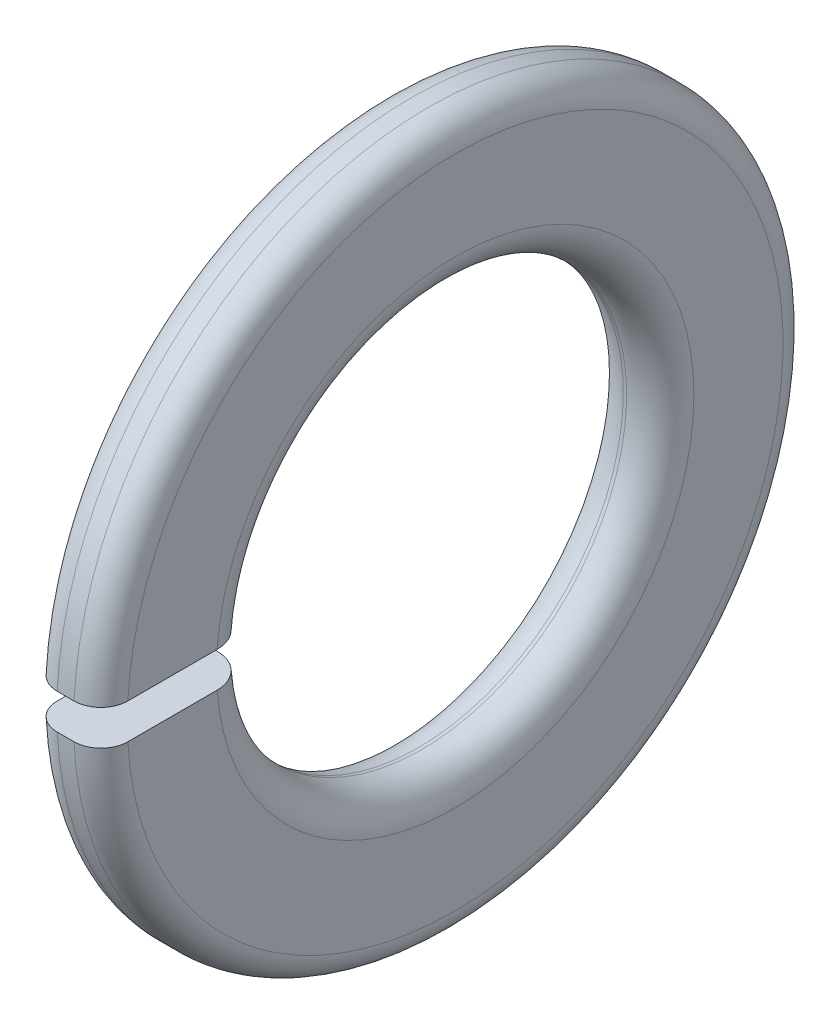
ISO-10303-21;
HEADER;
FILE_DESCRIPTION(('STEP AP214'),'2;1');
FILE_NAME('part.step','',(''),(''),'','','');
FILE_SCHEMA(('AUTOMOTIVE_DESIGN { 1 0 10303 214 1 1 1 1 }'));
ENDSEC;
DATA;
#1=APPLICATION_CONTEXT('core data for automotive mechanical design processes');
#2=APPLICATION_PROTOCOL_DEFINITION('international standard','automotive_design',2000,#1);
#3=PRODUCT_CONTEXT('',#1,'mechanical');
#4=PRODUCT('Part','Part','',(#3));
#5=PRODUCT_RELATED_PRODUCT_CATEGORY('part','',(#4));
#6=PRODUCT_DEFINITION_FORMATION('','',#4);
#7=PRODUCT_DEFINITION_CONTEXT('part definition',#1,'design');
#8=PRODUCT_DEFINITION('design','',#6,#7);
#9=PRODUCT_DEFINITION_SHAPE('','',#8);
#10=(LENGTH_UNIT() NAMED_UNIT(*) SI_UNIT(.MILLI.,.METRE.));
#11=(NAMED_UNIT(*) PLANE_ANGLE_UNIT() SI_UNIT($,.RADIAN.));
#12=(NAMED_UNIT(*) SI_UNIT($,.STERADIAN.) SOLID_ANGLE_UNIT());
#13=UNCERTAINTY_MEASURE_WITH_UNIT(LENGTH_MEASURE(1.E-05),#10,'distance_accuracy_value','');
#14=(GEOMETRIC_REPRESENTATION_CONTEXT(3) GLOBAL_UNCERTAINTY_ASSIGNED_CONTEXT((#13)) GLOBAL_UNIT_ASSIGNED_CONTEXT((#10,
#11,#12)) REPRESENTATION_CONTEXT('',''));
#15=CARTESIAN_POINT('',(0.,0.,0.));
#16=DIRECTION('',(0.,0.,1.));
#17=DIRECTION('',(1.,0.,0.));
#18=AXIS2_PLACEMENT_3D('',#15,#16,#17);
#19=CARTESIAN_POINT('',(-34.925,0.,0.));
#20=DIRECTION('',(-1.,0.,0.));
#21=DIRECTION('',(0.,0.,1.));
#22=AXIS2_PLACEMENT_3D('',#19,#20,#21);
#23=CYLINDRICAL_SURFACE('',#22,10.55);
#24=DIRECTION('',(-1.,0.,0.));
#25=VECTOR('',#24,1.);
#26=CARTESIAN_POINT('',(-34.925,0.525,10.5369291067179));
#27=LINE('',#26,#25);
#28=CARTESIAN_POINT('',(-0.8,0.525,10.5369291067179));
#29=VERTEX_POINT('',#28);
#30=CARTESIAN_POINT('',(-1.3,0.525,10.5369291067179));
#31=VERTEX_POINT('',#30);
#32=EDGE_CURVE('E169',#29,#31,#27,.T.);
#33=ORIENTED_EDGE('',*,*,#32,.F.);
#34=CARTESIAN_POINT('',(-0.8,0.,0.));
#35=DIRECTION('',(-1.,0.,0.));
#36=DIRECTION('',(0.,0.,1.));
#37=AXIS2_PLACEMENT_3D('',#34,#35,#36);
#38=CIRCLE('',#37,10.55);
#39=CARTESIAN_POINT('',(-0.8,-0.525,10.5369291067179));
#40=VERTEX_POINT('',#39);
#41=EDGE_CURVE('E118',#29,#40,#38,.T.);
#42=ORIENTED_EDGE('',*,*,#41,.T.);
#43=DIRECTION('',(-1.,0.,0.));
#44=VECTOR('',#43,1.);
#45=CARTESIAN_POINT('',(-34.925,-0.525,10.5369291067179));
#46=LINE('',#45,#44);
#47=CARTESIAN_POINT('',(-1.3,-0.525,10.5369291067179));
#48=VERTEX_POINT('',#47);
#49=EDGE_CURVE('E101',#48,#40,#46,.F.);
#50=ORIENTED_EDGE('',*,*,#49,.F.);
#51=CARTESIAN_POINT('',(-1.3,0.,0.));
#52=DIRECTION('',(1.,0.,0.));
#53=DIRECTION('',(0.,0.,-1.));
#54=AXIS2_PLACEMENT_3D('',#51,#52,#53);
#55=CIRCLE('',#54,10.55);
#56=EDGE_CURVE('E116',#48,#31,#55,.T.);
#57=ORIENTED_EDGE('',*,*,#56,.T.);
#58=EDGE_LOOP('',(#33,#42,#50,#57));
#59=FACE_BOUND('',#58,.T.);
#60=ADVANCED_FACE('F16',(#59),#23,.T.);
#61=CARTESIAN_POINT('',(0.,7.1,0.));
#62=DIRECTION('',(-1.,0.,0.));
#63=DIRECTION('',(0.,0.,1.));
#64=AXIS2_PLACEMENT_3D('',#61,#62,#63);
#65=PLANE('',#64);
#66=DIRECTION('',(0.,0.,1.));
#67=VECTOR('',#66,1.);
#68=CARTESIAN_POINT('',(0.,-0.525,0.));
#69=LINE('',#68,#67);
#70=CARTESIAN_POINT('',(0.,-0.525,7.08056318381525));
#71=VERTEX_POINT('',#70);
#72=CARTESIAN_POINT('',(0.,-0.525,9.73585512423023));
#73=VERTEX_POINT('',#72);
#74=EDGE_CURVE('E82',#71,#73,#69,.T.);
#75=ORIENTED_EDGE('',*,*,#74,.T.);
#76=CARTESIAN_POINT('',(0.,0.,0.));
#77=DIRECTION('',(-1.,0.,0.));
#78=DIRECTION('',(0.,0.,1.));
#79=AXIS2_PLACEMENT_3D('',#76,#77,#78);
#80=CIRCLE('',#79,9.75);
#81=CARTESIAN_POINT('',(0.,0.525,9.73585512423023));
#82=VERTEX_POINT('',#81);
#83=EDGE_CURVE('E40',#73,#82,#80,.F.);
#84=ORIENTED_EDGE('',*,*,#83,.T.);
#85=DIRECTION('',(0.,0.,-1.));
#86=VECTOR('',#85,1.);
#87=CARTESIAN_POINT('',(0.,0.525,10.761));
#88=LINE('',#87,#86);
#89=CARTESIAN_POINT('',(0.,0.525,7.08056318381525));
#90=VERTEX_POINT('',#89);
#91=EDGE_CURVE('E91',#82,#90,#88,.T.);
#92=ORIENTED_EDGE('',*,*,#91,.T.);
#93=CARTESIAN_POINT('',(0.,0.,0.));
#94=DIRECTION('',(-1.,0.,0.));
#95=DIRECTION('',(0.,0.,1.));
#96=AXIS2_PLACEMENT_3D('',#93,#94,#95);
#97=CIRCLE('',#96,7.1);
#98=EDGE_CURVE('E98',#90,#71,#97,.T.);
#99=ORIENTED_EDGE('',*,*,#98,.T.);
#100=EDGE_LOOP('',(#75,#84,#92,#99));
#101=FACE_BOUND('',#100,.T.);
#102=ADVANCED_FACE('F104',(#101),#65,.F.);
#103=CARTESIAN_POINT('',(-1.,0.,0.));
#104=DIRECTION('',(-1.,0.,0.));
#105=DIRECTION('',(0.,0.,1.));
#106=AXIS2_PLACEMENT_3D('',#103,#104,#105);
#107=TOROIDAL_SURFACE('',#106,7.1,1.);
#108=ORIENTED_EDGE('',*,*,#98,.F.);
#109=CARTESIAN_POINT('',(-0.812651191733093,0.525,6.09513809676691));
#110=CARTESIAN_POINT('',(-0.867635601609137,0.525,6.08461486650465));
#111=CARTESIAN_POINT('',(-0.923548451885151,0.525,6.07872721250442));
#112=CARTESIAN_POINT('',(-1.03561462486792,0.525,6.07642288324873));
#113=CARTESIAN_POINT('',(-1.09176815419271,0.525,6.0800174545316));
#114=CARTESIAN_POINT('',(-1.20265038202385,0.525,6.09658440071776));
#115=CARTESIAN_POINT('',(-1.25737978521658,0.525,6.1095520425659));
#116=CARTESIAN_POINT('',(-1.3638725672551,0.525,6.1444807255819));
#117=CARTESIAN_POINT('',(-1.41563665183698,0.525,6.16643961664033));
#118=CARTESIAN_POINT('',(-1.51480465325,0.525,6.21874173811228));
#119=CARTESIAN_POINT('',(-1.56220424214722,0.525,6.24909317391404));
#120=CARTESIAN_POINT('',(-1.65125714513638,0.525,6.31730121336709));
#121=CARTESIAN_POINT('',(-1.69291015600293,0.525,6.35515821280219));
#122=CARTESIAN_POINT('',(-1.76942266073897,0.525,6.43742442778353));
#123=CARTESIAN_POINT('',(-1.80426101306002,0.525,6.48185330577895));
#124=CARTESIAN_POINT('',(-1.86601254338545,0.525,6.57591381055086));
#125=CARTESIAN_POINT('',(-1.89292559206825,0.525,6.62554552220696));
#126=CARTESIAN_POINT('',(-1.93814923335002,0.525,6.72877362821626));
#127=CARTESIAN_POINT('',(-1.9564321571561,0.525,6.78238214534372));
#128=CARTESIAN_POINT('',(-1.98375580773735,0.525,6.89190498853626));
#129=CARTESIAN_POINT('',(-1.99279644616772,0.525,6.94781933663691));
#130=CARTESIAN_POINT('',(-2.00138749269398,0.525,7.06046876730558));
#131=CARTESIAN_POINT('',(-2.00092170716772,0.525,7.11720508578784));
#132=CARTESIAN_POINT('',(-1.99046919624137,0.525,7.22979418626396));
#133=CARTESIAN_POINT('',(-1.98048245114082,0.525,7.28564696642937));
#134=CARTESIAN_POINT('',(-1.9512682999192,0.525,7.39486566816648));
#135=CARTESIAN_POINT('',(-1.93204335803051,0.525,7.4482322487549));
#136=CARTESIAN_POINT('',(-1.88489151384658,0.525,7.55097199946706));
#137=CARTESIAN_POINT('',(-1.85696468214513,0.525,7.60034520198285));
#138=CARTESIAN_POINT('',(-1.7932516504448,0.525,7.69360308767889));
#139=CARTESIAN_POINT('',(-1.75747923413963,0.525,7.73749718733122));
#140=CARTESIAN_POINT('',(-1.67905745237818,0.525,7.81863927947804));
#141=CARTESIAN_POINT('',(-1.63640816840443,0.525,7.85588735070889));
#142=CARTESIAN_POINT('',(-1.54554883853143,0.525,7.92258902486458));
#143=CARTESIAN_POINT('',(-1.49735183074451,0.525,7.95206038814106));
#144=CARTESIAN_POINT('',(-1.39668650789301,0.525,8.00247439358284));
#145=CARTESIAN_POINT('',(-1.34421824229176,0.525,8.02341713449703));
#146=CARTESIAN_POINT('',(-1.23661255133491,0.525,8.05613801790862));
#147=CARTESIAN_POINT('',(-1.181480660204,0.525,8.06793436177104));
#148=CARTESIAN_POINT('',(-1.07001859143634,0.525,8.08209258223702));
#149=CARTESIAN_POINT('',(-1.01368842280445,0.525,8.08445452971335));
#150=CARTESIAN_POINT('',(-0.901493761658643,0.525,8.07967876415045));
#151=CARTESIAN_POINT('',(-0.845628830361041,0.525,8.07255135099469));
#152=CARTESIAN_POINT('',(-0.735888488372699,0.525,8.04901957603885));
#153=CARTESIAN_POINT('',(-0.682013074234786,0.525,8.03261523031341));
#154=CARTESIAN_POINT('',(-0.57777299393378,0.525,7.99099755957706));
#155=CARTESIAN_POINT('',(-0.527408710817191,0.525,7.96578327524504));
#156=CARTESIAN_POINT('',(-0.431620952055953,0.525,7.90726737931522));
#157=CARTESIAN_POINT('',(-0.386197502187286,0.525,7.87396572552912));
#158=CARTESIAN_POINT('',(-0.301516745674806,0.525,7.80017762775325));
#159=CARTESIAN_POINT('',(-0.26226736487093,0.525,7.75968208840675));
#160=CARTESIAN_POINT('',(-0.19110727232965,0.525,7.67268846366961));
#161=CARTESIAN_POINT('',(-0.159196627376645,0.525,7.62619032365977));
#162=CARTESIAN_POINT('',(-0.103547358484065,0.525,7.52840777006826));
#163=CARTESIAN_POINT('',(-0.0798260108357957,0.525,7.47711352456286));
#164=CARTESIAN_POINT('',(-0.0413094029115143,0.525,7.37127661987106));
#165=CARTESIAN_POINT('',(-0.0265142736222085,0.525,7.31673391302841));
#166=CARTESIAN_POINT('',(-0.00623645854835663,0.525,7.20581585945528));
#167=CARTESIAN_POINT('',(-0.000774997327997569,0.525,7.14943663215111));
#168=CARTESIAN_POINT('',(0.000621201945927826,0.525,7.03656007759808));
#169=CARTESIAN_POINT('',(-0.00344418247725166,0.525,6.98006274884024));
#170=CARTESIAN_POINT('',(-0.0209988630405946,0.525,6.86845999383313));
#171=CARTESIAN_POINT('',(-0.034502998710407,0.525,6.81335690113892));
#172=CARTESIAN_POINT('',(-0.0705702232944922,0.525,6.7062016776065));
#173=CARTESIAN_POINT('',(-0.0931329901304832,0.525,6.65414943837105));
#174=CARTESIAN_POINT('',(-0.14667933534619,0.525,6.55458295560761));
#175=CARTESIAN_POINT('',(-0.177661656097375,0.525,6.50706803577163));
#176=CARTESIAN_POINT('',(-0.247187964172001,0.525,6.41791501138345));
#177=CARTESIAN_POINT('',(-0.28573376833776,0.525,6.37627832299545));
#178=CARTESIAN_POINT('',(-0.369221248751563,0.525,6.30015644019461));
#179=CARTESIAN_POINT('',(-0.414152963572771,0.525,6.26566030926846));
#180=CARTESIAN_POINT('',(-0.509152346898683,0.525,6.20476708088215));
#181=CARTESIAN_POINT('',(-0.559213645064912,0.525,6.17836009650264));
#182=CARTESIAN_POINT('',(-0.643498874884665,0.525,6.14264746626716));
#183=CARTESIAN_POINT('',(-0.676607139318508,0.525,6.13064415460148));
#184=CARTESIAN_POINT('',(-0.743905094979395,0.525,6.11019627403516));
#185=CARTESIAN_POINT('',(-0.77809478442612,0.525,6.10175169927619));
#186=CARTESIAN_POINT('',(-0.812651191733093,0.525,6.09513809676691));
#187=B_SPLINE_CURVE_WITH_KNOTS('',3,(#109,#110,#111,#112,#113,#114,#115,#116,#117,#118,#119,
#120,#121,#122,#123,#124,#125,#126,#127,#128,#129,#130,#131,#132,#133,#134,#135,#136,#137,#138,
#139,#140,#141,#142,#143,#144,#145,#146,#147,#148,#149,#150,#151,#152,#153,#154,#155,#156,#157,
#158,#159,#160,#161,#162,#163,#164,#165,#166,#167,#168,#169,#170,#171,#172,#173,#174,#175,#176,
#177,#178,#179,#180,#181,#182,#183,#184,#185,#186),.UNSPECIFIED.,.T.,.F.,(4,2,2,2,2,2,2,2,2,2,2,
2,2,2,2,2,2,2,2,2,2,2,2,2,2,2,2,2,2,2,2,2,2,2,2,2,2,2,4),(0.,0.16781861044392,0.33583635418616,
0.503769314380746,0.671662139600458,0.839719697545761,1.00778611987009,1.17636595185943,
1.34494853450691,1.51406799423528,1.68318907052096,1.852598258409,2.02200779683398,
2.1913721713663,2.36073517197157,2.52980297346922,2.69886877186593,2.86754505098209,
3.03621937701959,3.2045571728161,3.37289370402848,3.54104766931508,3.70920134323298,
3.87737333324534,4.04554620055716,4.21393322500414,4.3823217817561,4.55106343388517,
4.71980756213288,4.88893490289837,5.05806441797011,5.22746043698934,5.39685043369166,
5.56621514250891,5.73562058474001,5.90476461293493,6.07370107312192,6.17917129305994,
6.28464133937424),.UNSPECIFIED.);
#188=CARTESIAN_POINT('',(-1.,0.525,6.07736579448695));
#189=VERTEX_POINT('',#188);
#190=EDGE_CURVE('E163',#90,#189,#187,.T.);
#191=ORIENTED_EDGE('',*,*,#190,.T.);
#192=CARTESIAN_POINT('',(-1.,0.,0.));
#193=DIRECTION('',(-1.,0.,0.));
#194=DIRECTION('',(0.,0.,1.));
#195=AXIS2_PLACEMENT_3D('',#192,#193,#194);
#196=CIRCLE('',#195,6.1);
#197=CARTESIAN_POINT('',(-1.,-0.525,6.07736579448695));
#198=VERTEX_POINT('',#197);
#199=EDGE_CURVE('E100',#189,#198,#196,.T.);
#200=ORIENTED_EDGE('',*,*,#199,.T.);
#201=CARTESIAN_POINT('',(-0.812651191733093,-0.525,6.09513809676691));
#202=CARTESIAN_POINT('',(-0.757551820377772,-0.525,6.1056884694128));
#203=CARTESIAN_POINT('',(-0.703304669040615,-0.525,6.12090939680118));
#204=CARTESIAN_POINT('',(-0.598094946051465,-0.525,6.16026480787611));
#205=CARTESIAN_POINT('',(-0.54713647672475,-0.525,6.18441018084276));
#206=CARTESIAN_POINT('',(-0.450021059862539,-0.525,6.2408970425833));
#207=CARTESIAN_POINT('',(-0.403861219137887,-0.525,6.27323355185951));
#208=CARTESIAN_POINT('',(-0.317622415271131,-0.525,6.34517125918678));
#209=CARTESIAN_POINT('',(-0.277541983733286,-0.525,6.3847706978582));
#210=CARTESIAN_POINT('',(-0.204475274845997,-0.525,6.47021702811072));
#211=CARTESIAN_POINT('',(-0.171506620941977,-0.525,6.51607899006993));
#212=CARTESIAN_POINT('',(-0.113707633488652,-0.525,6.6126750006121));
#213=CARTESIAN_POINT('',(-0.0888777550424561,-0.525,6.66340932144202));
#214=CARTESIAN_POINT('',(-0.0479873966962306,-0.525,6.76847554061402));
#215=CARTESIAN_POINT('',(-0.0319538960509596,-0.525,6.82281794020464));
#216=CARTESIAN_POINT('',(-0.00922268898903888,-0.525,6.93342153693679));
#217=CARTESIAN_POINT('',(-0.00252506205877568,-0.525,6.98968275041108));
#218=CARTESIAN_POINT('',(0.0013468749066364,-0.525,7.102614877748));
#219=CARTESIAN_POINT('',(-0.00149276131528073,-0.525,7.15928627056479));
#220=CARTESIAN_POINT('',(-0.0166506062854987,-0.525,7.27134714691279));
#221=CARTESIAN_POINT('',(-0.0289687946216183,-0.525,7.32673663320434));
#222=CARTESIAN_POINT('',(-0.0627331921988987,-0.525,7.43463047400923));
#223=CARTESIAN_POINT('',(-0.084174923605041,-0.525,7.48713622960314));
#224=CARTESIAN_POINT('',(-0.135585095866822,-0.525,7.5877931521059));
#225=CARTESIAN_POINT('',(-0.165553473435548,-0.525,7.63594435133185));
#226=CARTESIAN_POINT('',(-0.233108214576847,-0.525,7.72642784102522));
#227=CARTESIAN_POINT('',(-0.270680263456613,-0.525,7.76877081840133));
#228=CARTESIAN_POINT('',(-0.352414617320887,-0.525,7.84652983199311));
#229=CARTESIAN_POINT('',(-0.396576839430491,-0.525,7.88194595530469));
#230=CARTESIAN_POINT('',(-0.490128313916565,-0.525,7.94475961565249));
#231=CARTESIAN_POINT('',(-0.539505264712098,-0.525,7.97217547432639));
#232=CARTESIAN_POINT('',(-0.642167542773913,-0.525,8.01831006363213));
#233=CARTESIAN_POINT('',(-0.6954528267686,-0.525,8.03702889053743));
#234=CARTESIAN_POINT('',(-0.804309707920916,-0.525,8.06520338795658));
#235=CARTESIAN_POINT('',(-0.859876747627054,-0.525,8.0746766687945));
#236=CARTESIAN_POINT('',(-0.97181243576807,-0.525,8.08415006833351));
#237=CARTESIAN_POINT('',(-1.02818107863786,-0.525,8.08415025276899));
#238=CARTESIAN_POINT('',(-1.14006346169773,-0.525,8.07468209310414));
#239=CARTESIAN_POINT('',(-1.19557795969969,-0.525,8.06522270014709));
#240=CARTESIAN_POINT('',(-1.30423144094165,-0.525,8.0371203415121));
#241=CARTESIAN_POINT('',(-1.35737042597509,-0.525,8.01847738276766));
#242=CARTESIAN_POINT('',(-1.45978125760222,-0.525,7.97253595372864));
#243=CARTESIAN_POINT('',(-1.50905208951214,-0.525,7.9452352217515));
#244=CARTESIAN_POINT('',(-1.60231937757822,-0.525,7.88276033178289));
#245=CARTESIAN_POINT('',(-1.64631580508976,-0.525,7.84758613103461));
#246=CARTESIAN_POINT('',(-1.72785344320512,-0.525,7.77031242493912));
#247=CARTESIAN_POINT('',(-1.76538552963244,-0.525,7.72820329244293));
#248=CARTESIAN_POINT('',(-1.83286562277477,-0.525,7.63829324855709));
#249=CARTESIAN_POINT('',(-1.86281354537189,-0.525,7.59049227404641));
#250=CARTESIAN_POINT('',(-1.91434492958453,-0.525,7.4904454805055));
#251=CARTESIAN_POINT('',(-1.93591017809044,-0.525,7.43819028056314));
#252=CARTESIAN_POINT('',(-1.96998371435044,-0.525,7.33080620793395));
#253=CARTESIAN_POINT('',(-1.98249189521832,-0.525,7.27567730134156));
#254=CARTESIAN_POINT('',(-1.99812347198087,-0.525,7.16397881234495));
#255=CARTESIAN_POINT('',(-2.00122582734268,-0.525,7.10740628502484));
#256=CARTESIAN_POINT('',(-1.99790326108503,-0.525,6.99454140302498));
#257=CARTESIAN_POINT('',(-1.99147822288105,-0.525,6.93824905178213));
#258=CARTESIAN_POINT('',(-1.96926763971808,-0.525,6.82745983678813));
#259=CARTESIAN_POINT('',(-1.95346900171872,-0.525,6.77296559724566));
#260=CARTESIAN_POINT('',(-1.91294486876334,-0.525,6.66740346112664));
#261=CARTESIAN_POINT('',(-1.8882193380586,-0.525,6.6163355782723));
#262=CARTESIAN_POINT('',(-1.83054378340983,-0.525,6.51909489101566));
#263=CARTESIAN_POINT('',(-1.79759596405822,-0.525,6.47292077919656));
#264=CARTESIAN_POINT('',(-1.72440111454745,-0.525,6.38677676253839));
#265=CARTESIAN_POINT('',(-1.68415444353939,-0.525,6.34680655260639));
#266=CARTESIAN_POINT('',(-1.59760183615458,-0.525,6.274306679843));
#267=CARTESIAN_POINT('',(-1.55131036392622,-0.525,6.241759749429));
#268=CARTESIAN_POINT('',(-1.45389218246096,-0.525,6.18492227475377));
#269=CARTESIAN_POINT('',(-1.4027643594456,-0.525,6.16063363826697));
#270=CARTESIAN_POINT('',(-1.29730119774786,-0.525,6.1210894016019));
#271=CARTESIAN_POINT('',(-1.24297553119987,-0.525,6.10580796129274));
#272=CARTESIAN_POINT('',(-1.13257168095669,-0.525,6.0846310597706));
#273=CARTESIAN_POINT('',(-1.07649573567339,-0.525,6.07872407381752));
#274=CARTESIAN_POINT('',(-0.985554768608379,-0.525,6.07686069334114));
#275=CARTESIAN_POINT('',(-0.950724049159732,-0.525,6.07797678644269));
#276=CARTESIAN_POINT('',(-0.88136987143131,-0.525,6.08384165906486));
#277=CARTESIAN_POINT('',(-0.846846412428097,-0.525,6.08859043003013));
#278=CARTESIAN_POINT('',(-0.812651191733093,-0.525,6.09513809676691));
#279=B_SPLINE_CURVE_WITH_KNOTS('',3,(#201,#202,#203,#204,#205,#206,#207,#208,#209,#210,#211,
#212,#213,#214,#215,#216,#217,#218,#219,#220,#221,#222,#223,#224,#225,#226,#227,#228,#229,#230,
#231,#232,#233,#234,#235,#236,#237,#238,#239,#240,#241,#242,#243,#244,#245,#246,#247,#248,#249,
#250,#251,#252,#253,#254,#255,#256,#257,#258,#259,#260,#261,#262,#263,#264,#265,#266,#267,#268,
#269,#270,#271,#272,#273,#274,#275,#276,#277,#278),.UNSPECIFIED.,.T.,.F.,(4,2,2,2,2,2,2,2,2,2,2,
2,2,2,2,2,2,2,2,2,2,2,2,2,2,2,2,2,2,2,2,2,2,2,2,2,2,2,4),(0.,0.168173561321525,0.33655300290605,
0.504830329078216,0.673066945284254,0.841715791617975,1.01037406683032,1.1795467802066,
1.34872093392429,1.51814257717999,1.68756385558508,1.85690207776354,2.02623904310391,
2.19526013120716,2.36427909396017,2.53290788784446,2.70153481501588,2.86983992189747,
3.03814386089982,3.20628869252954,3.37443339721201,3.54262206281087,3.71081164177944,
3.87923670251715,4.0476636312185,4.21645448401338,4.38524732874635,4.55441748014898,
4.72358970166495,4.89299878102249,5.06240853880469,5.23177292248635,5.40112897459559,
5.57008696917316,5.73908396879071,5.90759375449007,6.07589621718199,6.1802666563824,
6.28463684978025),.UNSPECIFIED.);
#280=EDGE_CURVE('E86',#198,#71,#279,.T.);
#281=ORIENTED_EDGE('',*,*,#280,.T.);
#282=EDGE_LOOP('',(#108,#191,#200,#281));
#283=FACE_BOUND('',#282,.T.);
#284=ADVANCED_FACE('F96',(#283),#107,.T.);
#285=CARTESIAN_POINT('',(-34.925,0.,0.));
#286=DIRECTION('',(-1.,0.,0.));
#287=DIRECTION('',(0.,0.,1.));
#288=AXIS2_PLACEMENT_3D('',#285,#286,#287);
#289=CYLINDRICAL_SURFACE('',#288,6.1);
#290=DIRECTION('',(-1.,0.,0.));
#291=VECTOR('',#290,1.);
#292=CARTESIAN_POINT('',(-34.925,0.525,6.07736579448695));
#293=LINE('',#292,#291);
#294=CARTESIAN_POINT('',(-1.1,0.525,6.07736579448695));
#295=VERTEX_POINT('',#294);
#296=EDGE_CURVE('E170',#295,#189,#293,.F.);
#297=ORIENTED_EDGE('',*,*,#296,.F.);
#298=CARTESIAN_POINT('',(-1.1,0.,0.));
#299=DIRECTION('',(-1.,0.,0.));
#300=DIRECTION('',(0.,0.,1.));
#301=AXIS2_PLACEMENT_3D('',#298,#299,#300);
#302=CIRCLE('',#301,6.1);
#303=CARTESIAN_POINT('',(-1.1,-0.525,6.07736579448695));
#304=VERTEX_POINT('',#303);
#305=EDGE_CURVE('E111',#295,#304,#302,.T.);
#306=ORIENTED_EDGE('',*,*,#305,.T.);
#307=DIRECTION('',(-1.,0.,0.));
#308=VECTOR('',#307,1.);
#309=CARTESIAN_POINT('',(-34.925,-0.525,6.07736579448695));
#310=LINE('',#309,#308);
#311=EDGE_CURVE('E102',#198,#304,#310,.T.);
#312=ORIENTED_EDGE('',*,*,#311,.F.);
#313=ORIENTED_EDGE('',*,*,#199,.F.);
#314=EDGE_LOOP('',(#297,#306,#312,#313));
#315=FACE_BOUND('',#314,.T.);
#316=ADVANCED_FACE('F159',(#315),#289,.F.);
#317=CARTESIAN_POINT('',(-1.1,0.,0.));
#318=DIRECTION('',(-1.,0.,0.));
#319=DIRECTION('',(0.,0.,1.));
#320=AXIS2_PLACEMENT_3D('',#317,#318,#319);
#321=TOROIDAL_SURFACE('',#320,7.1,1.);
#322=ORIENTED_EDGE('',*,*,#305,.F.);
#323=CARTESIAN_POINT('',(-1.45625333670172,0.525,6.14321813138294));
#324=CARTESIAN_POINT('',(-1.50873427205085,0.525,6.16330311942423));
#325=CARTESIAN_POINT('',(-1.55955360068142,0.525,6.18784634713152));
#326=CARTESIAN_POINT('',(-1.65638706058515,0.525,6.24514561447174));
#327=CARTESIAN_POINT('',(-1.7023951668367,0.525,6.27791178113825));
#328=CARTESIAN_POINT('',(-1.78823668340031,0.525,6.35068084397298));
#329=CARTESIAN_POINT('',(-1.82807391562946,0.525,6.39067922734173));
#330=CARTESIAN_POINT('',(-1.9004763631869,0.525,6.47677057698412));
#331=CARTESIAN_POINT('',(-1.93304336162146,0.525,6.52286204443546));
#332=CARTESIAN_POINT('',(-1.99008551463174,0.525,6.61996518269096));
#333=CARTESIAN_POINT('',(-2.01453981524313,0.525,6.67098910484014));
#334=CARTESIAN_POINT('',(-2.05455916522718,0.525,6.77641378610767));
#335=CARTESIAN_POINT('',(-2.07012373761965,0.525,6.83081472624703));
#336=CARTESIAN_POINT('',(-2.09195167112648,0.525,6.94158357277009));
#337=CARTESIAN_POINT('',(-2.0981933307575,0.525,6.997955756822));
#338=CARTESIAN_POINT('',(-2.10112850415578,0.525,7.11094833049082));
#339=CARTESIAN_POINT('',(-2.09782198988538,0.525,7.16756872083608));
#340=CARTESIAN_POINT('',(-2.08174613004872,0.525,7.27947412466098));
#341=CARTESIAN_POINT('',(-2.06897288997063,0.525,7.33475857888225));
#342=CARTESIAN_POINT('',(-2.03431405467515,0.525,7.44239349287873));
#343=CARTESIAN_POINT('',(-2.01242852316394,0.525,7.49474397316313));
#344=CARTESIAN_POINT('',(-1.96019367603179,0.525,7.5949492048703));
#345=CARTESIAN_POINT('',(-1.92985555916539,0.525,7.64280979352126));
#346=CARTESIAN_POINT('',(-1.86155801604784,0.525,7.73274357904554));
#347=CARTESIAN_POINT('',(-1.82359866560491,0.525,7.77481683347832));
#348=CARTESIAN_POINT('',(-1.74122591675457,0.525,7.85188170461818));
#349=CARTESIAN_POINT('',(-1.69682700503943,0.525,7.88688880566625));
#350=CARTESIAN_POINT('',(-1.60277146554129,0.525,7.94893271941365));
#351=CARTESIAN_POINT('',(-1.55311490393918,0.525,7.97596963242186));
#352=CARTESIAN_POINT('',(-1.45007073728155,0.525,8.02124493385038));
#353=CARTESIAN_POINT('',(-1.39669153373566,0.525,8.03950244458679));
#354=CARTESIAN_POINT('',(-1.28762325470192,0.525,8.06678203143009));
#355=CARTESIAN_POINT('',(-1.23193420030199,0.525,8.07580419183236));
#356=CARTESIAN_POINT('',(-1.11991372636769,0.525,8.08434727168261));
#357=CARTESIAN_POINT('',(-1.06358335801182,0.525,8.08388198034008));
#358=CARTESIAN_POINT('',(-0.951801086675145,0.525,8.07349747290158));
#359=CARTESIAN_POINT('',(-0.896349180296673,0.525,8.06357829337993));
#360=CARTESIAN_POINT('',(-0.787915689078316,0.525,8.03457553709174));
#361=CARTESIAN_POINT('',(-0.73493331228123,0.525,8.01549492081466));
#362=CARTESIAN_POINT('',(-0.632919955383067,0.525,7.9687171434209));
#363=CARTESIAN_POINT('',(-0.5838889857235,0.525,7.94101995953607));
#364=CARTESIAN_POINT('',(-0.491121495068031,0.525,7.87777224721527));
#365=CARTESIAN_POINT('',(-0.447389707302115,0.525,7.84221477686123));
#366=CARTESIAN_POINT('',(-0.366502710282255,0.525,7.76427500720273));
#367=CARTESIAN_POINT('',(-0.329347556085088,0.525,7.7218926507689));
#368=CARTESIAN_POINT('',(-0.262592809554553,0.525,7.63142289729931));
#369=CARTESIAN_POINT('',(-0.23300744433889,0.525,7.58332500290415));
#370=CARTESIAN_POINT('',(-0.182310171566145,0.525,7.4828537284778));
#371=CARTESIAN_POINT('',(-0.161198371804038,0.525,7.43048029406628));
#372=CARTESIAN_POINT('',(-0.12799654858553,0.525,7.32281557968108));
#373=CARTESIAN_POINT('',(-0.115927418368476,0.525,7.26751785647979));
#374=CARTESIAN_POINT('',(-0.101224566142857,0.525,7.15568196132155));
#375=CARTESIAN_POINT('',(-0.098590949601937,0.525,7.09914377550616));
#376=CARTESIAN_POINT('',(-0.102833030521148,0.525,6.98631637840221));
#377=CARTESIAN_POINT('',(-0.109726973277713,0.525,6.93002785247584));
#378=CARTESIAN_POINT('',(-0.132860805043382,0.525,6.81940480685292));
#379=CARTESIAN_POINT('',(-0.149100774478115,0.525,6.76507030397567));
#380=CARTESIAN_POINT('',(-0.190482848476032,0.525,6.65986600674406));
#381=CARTESIAN_POINT('',(-0.215630278453979,0.525,6.60899830679347));
#382=CARTESIAN_POINT('',(-0.274119058558702,0.525,6.5122139680643));
#383=CARTESIAN_POINT('',(-0.307460391216741,0.525,6.46629731873079));
#384=CARTESIAN_POINT('',(-0.38134859280872,0.525,6.38078854589324));
#385=CARTESIAN_POINT('',(-0.421885867538046,0.525,6.34118813292589));
#386=CARTESIAN_POINT('',(-0.509049460776129,0.525,6.26938140730713));
#387=CARTESIAN_POINT('',(-0.555675443467099,0.525,6.23717468713254));
#388=CARTESIAN_POINT('',(-0.653539286250299,0.525,6.18117605474247));
#389=CARTESIAN_POINT('',(-0.704762305731261,0.525,6.1573582057297));
#390=CARTESIAN_POINT('',(-0.810503174747228,0.525,6.11868667922326));
#391=CARTESIAN_POINT('',(-0.865021780165819,0.525,6.10383506689553));
#392=CARTESIAN_POINT('',(-0.975623812011182,0.525,6.08356616942027));
#393=CARTESIAN_POINT('',(-1.03170249521718,0.525,6.07812291348708));
#394=CARTESIAN_POINT('',(-1.14392866236903,0.525,6.07675769072237));
#395=CARTESIAN_POINT('',(-1.20007597810204,0.525,6.08082407867976));
#396=CARTESIAN_POINT('',(-1.28973394203961,0.525,6.09498038981748));
#397=CARTESIAN_POINT('',(-1.32372569210998,0.525,6.1021882062522));
#398=CARTESIAN_POINT('',(-1.3907741351476,0.525,6.12010286916448));
#399=CARTESIAN_POINT('',(-1.42383083011473,0.525,6.13080970815771));
#400=CARTESIAN_POINT('',(-1.45625333670172,0.525,6.14321813138294));
#401=B_SPLINE_CURVE_WITH_KNOTS('',3,(#323,#324,#325,#326,#327,#328,#329,#330,#331,#332,#333,
#334,#335,#336,#337,#338,#339,#340,#341,#342,#343,#344,#345,#346,#347,#348,#349,#350,#351,#352,
#353,#354,#355,#356,#357,#358,#359,#360,#361,#362,#363,#364,#365,#366,#367,#368,#369,#370,#371,
#372,#373,#374,#375,#376,#377,#378,#379,#380,#381,#382,#383,#384,#385,#386,#387,#388,#389,#390,
#391,#392,#393,#394,#395,#396,#397,#398,#399,#400),.UNSPECIFIED.,.T.,.F.,(4,2,2,2,2,2,2,2,2,2,2,
2,2,2,2,2,2,2,2,2,2,2,2,2,2,2,2,2,2,2,2,2,2,2,2,2,2,2,4),(0.,0.168451797914004,
0.337112081056439,0.505667483528513,0.674181500370167,0.843125391114072,1.01207834572552,
1.18142397231783,1.35077009618429,1.52018592597012,1.68960057134951,1.85879181949371,
2.02798138478004,2.19679607410601,2.36560863872245,2.53405183018113,2.70249348416576,
2.87069033991177,3.03888654495632,3.20702843446932,3.37517076827912,3.54346219678329,
3.71175503408504,3.8803618854065,4.04897088156242,4.21796826033241,4.38696752810396,
4.55629087866397,4.7256156863288,4.89504189787458,5.06446774822051,5.23366938029597,
5.40286168413003,5.57152618811327,5.74022952527108,5.90846642629471,6.07649741759268,
6.18056646997084,6.28463529974917),.UNSPECIFIED.);
#402=CARTESIAN_POINT('',(-2.1,0.525,7.08056318381525));
#403=VERTEX_POINT('',#402);
#404=EDGE_CURVE('E182',#295,#403,#401,.T.);
#405=ORIENTED_EDGE('',*,*,#404,.T.);
#406=CARTESIAN_POINT('',(-2.1,0.,0.));
#407=DIRECTION('',(-1.,0.,0.));
#408=DIRECTION('',(0.,0.,1.));
#409=AXIS2_PLACEMENT_3D('',#406,#407,#408);
#410=CIRCLE('',#409,7.1);
#411=CARTESIAN_POINT('',(-2.1,-0.525,7.08056318381525));
#412=VERTEX_POINT('',#411);
#413=EDGE_CURVE('E172',#403,#412,#410,.T.);
#414=ORIENTED_EDGE('',*,*,#413,.T.);
#415=CARTESIAN_POINT('',(-1.45625333670172,-0.525,6.14321813138294));
#416=CARTESIAN_POINT('',(-1.40396338684395,-0.525,6.12321160433755));
#417=CARTESIAN_POINT('',(-1.34994826560774,-0.525,6.1076015049569));
#418=CARTESIAN_POINT('',(-1.24001959369771,-0.525,6.08565972259131));
#419=CARTESIAN_POINT('',(-1.18410389171519,-0.525,6.0793389382106));
#420=CARTESIAN_POINT('',(-1.07202501841815,-0.525,6.07618335281239));
#421=CARTESIAN_POINT('',(-1.01586196757445,-0.525,6.07934435494251));
#422=CARTESIAN_POINT('',(-0.904879619281964,-0.525,6.09505236449142));
#423=CARTESIAN_POINT('',(-0.850060001464877,-0.525,6.1075971112269));
#424=CARTESIAN_POINT('',(-0.743304902224789,-0.525,6.14170361573484));
#425=CARTESIAN_POINT('',(-0.691369273753007,-0.525,6.16326491329254));
#426=CARTESIAN_POINT('',(-0.591841806795936,-0.525,6.21478272629007));
#427=CARTESIAN_POINT('',(-0.544250174174381,-0.525,6.24473963932798));
#428=CARTESIAN_POINT('',(-0.454647513651609,-0.525,6.31226435141228));
#429=CARTESIAN_POINT('',(-0.412649082872774,-0.525,6.34984886493713));
#430=CARTESIAN_POINT('',(-0.335531906951975,-0.525,6.43151400891372));
#431=CARTESIAN_POINT('',(-0.300413273544474,-0.525,6.47559474484994));
#432=CARTESIAN_POINT('',(-0.237927756240322,-0.525,6.56916098832082));
#433=CARTESIAN_POINT('',(-0.210587423019332,-0.525,6.61866422749906));
#434=CARTESIAN_POINT('',(-0.164580494346768,-0.525,6.72154928007484));
#435=CARTESIAN_POINT('',(-0.145914019678513,-0.525,6.77493114747024));
#436=CARTESIAN_POINT('',(-0.117739459465927,-0.525,6.88420884901742));
#437=CARTESIAN_POINT('',(-0.108255454090936,-0.525,6.94011089296055));
#438=CARTESIAN_POINT('',(-0.0987991462172873,-0.525,7.0527140787603));
#439=CARTESIAN_POINT('',(-0.0988269157197316,-0.525,7.10941522666263));
#440=CARTESIAN_POINT('',(-0.108400925719397,-0.525,7.22205168076927));
#441=CARTESIAN_POINT('',(-0.117954332622022,-0.525,7.27798637823302));
#442=CARTESIAN_POINT('',(-0.146326251812084,-0.525,7.38745475627797));
#443=CARTESIAN_POINT('',(-0.165144727136634,-0.525,7.44098844643703));
#444=CARTESIAN_POINT('',(-0.211495246729916,-0.525,7.54407176996099));
#445=CARTESIAN_POINT('',(-0.239017929622293,-0.525,7.59362561218633));
#446=CARTESIAN_POINT('',(-0.302008953806548,-0.525,7.6873960646476));
#447=CARTESIAN_POINT('',(-0.337477213732038,-0.525,7.73161272953157));
#448=CARTESIAN_POINT('',(-0.415272448628572,-0.525,7.81335233335323));
#449=CARTESIAN_POINT('',(-0.457584652652763,-0.525,7.8508893302188));
#450=CARTESIAN_POINT('',(-0.547922604316175,-0.525,7.9183076103752));
#451=CARTESIAN_POINT('',(-0.595948281427545,-0.525,7.94818898815363));
#452=CARTESIAN_POINT('',(-0.696233395757092,-0.525,7.99937792217349));
#453=CARTESIAN_POINT('',(-0.748483058481809,-0.525,8.02070462848615));
#454=CARTESIAN_POINT('',(-0.855824785138397,-0.525,8.05426724831559));
#455=CARTESIAN_POINT('',(-0.910916820813998,-0.525,8.0665032521852));
#456=CARTESIAN_POINT('',(-1.02228383896306,-0.525,8.08152009814956));
#457=CARTESIAN_POINT('',(-1.07855676552888,-0.525,8.08431619056593));
#458=CARTESIAN_POINT('',(-1.19077247964337,-0.525,8.08041568885753));
#459=CARTESIAN_POINT('',(-1.24671526884066,-0.525,8.07371914217677));
#460=CARTESIAN_POINT('',(-1.3566520463781,-0.525,8.05103187615351));
#461=CARTESIAN_POINT('',(-1.41064705406613,-0.525,8.03504609542258));
#462=CARTESIAN_POINT('',(-1.51518957558512,-0.525,7.99424245930992));
#463=CARTESIAN_POINT('',(-1.56573708287749,-0.525,7.96942458717761));
#464=CARTESIAN_POINT('',(-1.66198907673036,-0.525,7.91164655738373));
#465=CARTESIAN_POINT('',(-1.70769021073889,-0.525,7.87868081514369));
#466=CARTESIAN_POINT('',(-1.79292126787159,-0.525,7.80555690771568));
#467=CARTESIAN_POINT('',(-1.83245115068212,-0.525,7.76539869554664));
#468=CARTESIAN_POINT('',(-1.90429251561452,-0.525,7.67895719044652));
#469=CARTESIAN_POINT('',(-1.93659140953185,-0.525,7.6326634359145));
#470=CARTESIAN_POINT('',(-1.99297934593807,-0.525,7.53532032930188));
#471=CARTESIAN_POINT('',(-2.01706827586282,-0.525,7.48427091203013));
#472=CARTESIAN_POINT('',(-2.05641064090645,-0.525,7.37874136434829));
#473=CARTESIAN_POINT('',(-2.07164382387788,-0.525,7.32425368372436));
#474=CARTESIAN_POINT('',(-2.09276708398684,-0.525,7.21349631851773));
#475=CARTESIAN_POINT('',(-2.09865702546543,-0.525,7.15722660807299));
#476=CARTESIAN_POINT('',(-2.10093554016092,-0.525,7.04437837570972));
#477=CARTESIAN_POINT('',(-2.09730442434329,-0.525,6.98779945569367));
#478=CARTESIAN_POINT('',(-2.08060414222632,-0.525,6.8760539922542));
#479=CARTESIAN_POINT('',(-2.06753526716064,-0.525,6.82088740530289));
#480=CARTESIAN_POINT('',(-2.03231416120702,-0.525,6.71348634844032));
#481=CARTESIAN_POINT('',(-2.01015483417327,-0.525,6.66125420549783));
#482=CARTESIAN_POINT('',(-1.95736643053349,-0.525,6.56124249509386));
#483=CARTESIAN_POINT('',(-1.92673526883799,-0.525,6.51346402764736));
#484=CARTESIAN_POINT('',(-1.85789211046836,-0.525,6.42376845863985));
#485=CARTESIAN_POINT('',(-1.81968404885727,-0.525,6.38184833373321));
#486=CARTESIAN_POINT('',(-1.73678148684901,-0.525,6.30508131201252));
#487=CARTESIAN_POINT('',(-1.69209494964875,-0.525,6.27022585580535));
#488=CARTESIAN_POINT('',(-1.61520987064193,-0.525,6.220090086971));
#489=CARTESIAN_POINT('',(-1.584578907779,-0.525,6.20236024597543));
#490=CARTESIAN_POINT('',(-1.5216124373362,-0.525,6.17024180733262));
#491=CARTESIAN_POINT('',(-1.48927693141589,-0.525,6.15585320643239));
#492=CARTESIAN_POINT('',(-1.45625333670172,-0.525,6.14321813138294));
#493=B_SPLINE_CURVE_WITH_KNOTS('',3,(#415,#416,#417,#418,#419,#420,#421,#422,#423,#424,#425,
#426,#427,#428,#429,#430,#431,#432,#433,#434,#435,#436,#437,#438,#439,#440,#441,#442,#443,#444,
#445,#446,#447,#448,#449,#450,#451,#452,#453,#454,#455,#456,#457,#458,#459,#460,#461,#462,#463,
#464,#465,#466,#467,#468,#469,#470,#471,#472,#473,#474,#475,#476,#477,#478,#479,#480,#481,#482,
#483,#484,#485,#486,#487,#488,#489,#490,#491,#492),.UNSPECIFIED.,.T.,.F.,(4,2,2,2,2,2,2,2,2,2,2,
2,2,2,2,2,2,2,2,2,2,2,2,2,2,2,2,2,2,2,2,2,2,2,2,2,2,2,4),(0.,0.167830972660986,
0.335858694722919,0.503812054904614,0.671724965656136,0.839629306992063,1.00754160125636,
1.17582589627703,1.34411292416844,1.51296767848104,1.68182478402252,1.8511235117576,
2.02042352103005,2.18985099564511,2.35927779433663,2.52852299063704,2.69776645386751,
2.86664940515356,3.03553027194288,3.20403095172224,3.37252995674476,3.54075661844883,
3.70898243936268,3.87711890491572,4.04525568935115,4.21350803646147,4.38176148263277,
4.55030559692807,4.71885202198418,4.88778239364827,5.05671521806988,5.22599766186975,
5.39527488211628,5.56468449495818,5.73413584008523,5.90349941005081,6.07265653992159,
6.17864989873588,6.28464315435607),.UNSPECIFIED.);
#494=EDGE_CURVE('E90',#412,#304,#493,.T.);
#495=ORIENTED_EDGE('',*,*,#494,.T.);
#496=EDGE_LOOP('',(#322,#405,#414,#495));
#497=FACE_BOUND('',#496,.T.);
#498=ADVANCED_FACE('F181',(#497),#321,.T.);
#499=CARTESIAN_POINT('',(-2.1,10.55,0.));
#500=DIRECTION('',(1.,0.,0.));
#501=DIRECTION('',(0.,0.,-1.));
#502=AXIS2_PLACEMENT_3D('',#499,#500,#501);
#503=PLANE('',#502);
#504=DIRECTION('',(0.,0.,-1.));
#505=VECTOR('',#504,1.);
#506=CARTESIAN_POINT('',(-2.1,0.525,0.));
#507=LINE('',#506,#505);
#508=CARTESIAN_POINT('',(-2.1,0.525,9.73585512423023));
#509=VERTEX_POINT('',#508);
#510=EDGE_CURVE('E109',#509,#403,#507,.T.);
#511=ORIENTED_EDGE('',*,*,#510,.F.);
#512=CARTESIAN_POINT('',(-2.1,0.,0.));
#513=DIRECTION('',(1.,0.,0.));
#514=DIRECTION('',(0.,0.,-1.));
#515=AXIS2_PLACEMENT_3D('',#512,#513,#514);
#516=CIRCLE('',#515,9.75);
#517=CARTESIAN_POINT('',(-2.1,-0.525,9.73585512423023));
#518=VERTEX_POINT('',#517);
#519=EDGE_CURVE('E11',#509,#518,#516,.F.);
#520=ORIENTED_EDGE('',*,*,#519,.T.);
#521=DIRECTION('',(0.,0.,1.));
#522=VECTOR('',#521,1.);
#523=CARTESIAN_POINT('',(-2.1,-0.525,0.));
#524=LINE('',#523,#522);
#525=EDGE_CURVE('E106',#412,#518,#524,.T.);
#526=ORIENTED_EDGE('',*,*,#525,.F.);
#527=ORIENTED_EDGE('',*,*,#413,.F.);
#528=EDGE_LOOP('',(#511,#520,#526,#527));
#529=FACE_BOUND('',#528,.T.);
#530=ADVANCED_FACE('F137',(#529),#503,.F.);
#531=CARTESIAN_POINT('',(-2.1,-0.525,0.));
#532=DIRECTION('',(0.,1.,0.));
#533=DIRECTION('',(0.,0.,1.));
#534=AXIS2_PLACEMENT_3D('',#531,#532,#533);
#535=PLANE('',#534);
#536=ORIENTED_EDGE('',*,*,#49,.T.);
#537=CARTESIAN_POINT('',(-0.8,-0.525,10.5369291067179));
#538=CARTESIAN_POINT('',(-0.755034701350673,-0.525,10.5369675496387));
#539=CARTESIAN_POINT('',(-0.710081131398666,-0.525,10.5331356923052));
#540=CARTESIAN_POINT('',(-0.621482092464717,-0.525,10.5180154178145));
#541=CARTESIAN_POINT('',(-0.577835583584625,-0.525,10.5067331023915));
#542=CARTESIAN_POINT('',(-0.493037785088176,-0.525,10.476988126799));
#543=CARTESIAN_POINT('',(-0.451887675569928,-0.525,10.4585221008518));
#544=CARTESIAN_POINT('',(-0.373275785266008,-0.525,10.4149527265973));
#545=CARTESIAN_POINT('',(-0.335813390421587,-0.525,10.3898504858919));
#546=CARTESIAN_POINT('',(-0.265610690068845,-0.525,10.3337048443018));
#547=CARTESIAN_POINT('',(-0.23287281823795,-0.525,10.302658400485));
#548=CARTESIAN_POINT('',(-0.173059993324836,-0.525,10.2355087716591));
#549=CARTESIAN_POINT('',(-0.14598615824713,-0.525,10.1994045906645));
#550=CARTESIAN_POINT('',(-0.0982395219864738,-0.525,10.1231212762611));
#551=CARTESIAN_POINT('',(-0.0775755892667706,-0.525,10.0829365983181));
#552=CARTESIAN_POINT('',(-0.0432882267560404,-0.525,9.99967904573569));
#553=CARTESIAN_POINT('',(-0.0296608210845179,-0.525,9.95660781767553));
#554=CARTESIAN_POINT('',(-0.0131795794662958,-0.525,9.88370846238698));
#555=CARTESIAN_POINT('',(-0.00824015077758766,-0.525,9.85433478477519));
#556=CARTESIAN_POINT('',(-0.00165076907434508,-0.525,9.79526316003447));
#557=CARTESIAN_POINT('',(3.85319723322692E-06,-0.525,9.76556573361336));
#558=CARTESIAN_POINT('',(0.,-0.525,9.73585512423023));
#559=B_SPLINE_CURVE_WITH_KNOTS('',3,(#537,#538,#539,#540,#541,#542,#543,#544,#545,#546,#547,
#548,#549,#550,#551,#552,#553,#554,#555,#556,#557,#558),.UNSPECIFIED.,.F.,.F.,(4,2,2,2,2,2,2,2,
2,2,4),(0.,0.134716052620778,0.269321912849918,0.403990915951942,0.538637456615945,
0.673353110175328,0.808095329752502,0.943023149793359,1.07787464730434,1.16706162602783,
1.25612173701302),.UNSPECIFIED.);
#560=EDGE_CURVE('E88',#40,#73,#559,.T.);
#561=ORIENTED_EDGE('',*,*,#560,.T.);
#562=ORIENTED_EDGE('',*,*,#74,.F.);
#563=ORIENTED_EDGE('',*,*,#280,.F.);
#564=ORIENTED_EDGE('',*,*,#311,.T.);
#565=ORIENTED_EDGE('',*,*,#494,.F.);
#566=ORIENTED_EDGE('',*,*,#525,.T.);
#567=CARTESIAN_POINT('',(-2.1,-0.525,9.73585512423023));
#568=CARTESIAN_POINT('',(-2.10003805207029,-0.525,9.78096802705605));
#569=CARTESIAN_POINT('',(-2.09619737509941,-0.525,9.82607001982904));
#570=CARTESIAN_POINT('',(-2.08103780939708,-0.525,9.91496651881509));
#571=CARTESIAN_POINT('',(-2.06972445219578,-0.525,9.95876196713263));
#572=CARTESIAN_POINT('',(-2.03989057379137,-0.525,10.043851351729));
#573=CARTESIAN_POINT('',(-2.02136645894681,-0.525,10.0851440288186));
#574=CARTESIAN_POINT('',(-1.97764964469646,-0.525,10.1640232007963));
#575=CARTESIAN_POINT('',(-1.95245821053165,-0.525,10.2016103970091));
#576=CARTESIAN_POINT('',(-1.89613536303248,-0.525,10.2719892817274));
#577=CARTESIAN_POINT('',(-1.86500829772661,-0.525,10.3047844496696));
#578=CARTESIAN_POINT('',(-1.79767657258609,-0.525,10.3646820454977));
#579=CARTESIAN_POINT('',(-1.76147093083798,-0.525,10.391783369975));
#580=CARTESIAN_POINT('',(-1.68506217285032,-0.525,10.4394827284206));
#581=CARTESIAN_POINT('',(-1.64486343416959,-0.525,10.4600877828816));
#582=CARTESIAN_POINT('',(-1.56158275369754,-0.525,10.4942372505365));
#583=CARTESIAN_POINT('',(-1.51850257052202,-0.525,10.5077859268305));
#584=CARTESIAN_POINT('',(-1.445960931275,-0.525,10.5240341826626));
#585=CARTESIAN_POINT('',(-1.41695939990426,-0.525,10.5288668722181));
#586=CARTESIAN_POINT('',(-1.3586426712132,-0.525,10.5353138739903));
#587=CARTESIAN_POINT('',(-1.32932797887558,-0.525,10.5369327554443));
#588=CARTESIAN_POINT('',(-1.3,-0.525,10.5369291067179));
#589=B_SPLINE_CURVE_WITH_KNOTS('',3,(#567,#568,#569,#570,#571,#572,#573,#574,#575,#576,#577,
#578,#579,#580,#581,#582,#583,#584,#585,#586,#587,#588),.UNSPECIFIED.,.F.,.F.,(4,2,2,2,2,2,2,2,
2,2,4),(0.,0.135159954592235,0.270219971180529,0.40534738428703,0.540449172955921,
0.675452373052591,0.810481711309563,0.945364619696519,1.0801659439753,1.1682046168553,
1.25611803069771),.UNSPECIFIED.);
#590=EDGE_CURVE('E121',#518,#48,#589,.T.);
#591=ORIENTED_EDGE('',*,*,#590,.T.);
#592=EDGE_LOOP('',(#536,#561,#562,#563,#564,#565,#566,#591));
#593=FACE_BOUND('',#592,.T.);
#594=ADVANCED_FACE('F85',(#593),#535,.T.);
#595=CARTESIAN_POINT('',(-2.1,0.525,10.761));
#596=DIRECTION('',(0.,-1.,0.));
#597=DIRECTION('',(0.,0.,-1.));
#598=AXIS2_PLACEMENT_3D('',#595,#596,#597);
#599=PLANE('',#598);
#600=ORIENTED_EDGE('',*,*,#91,.F.);
#601=CARTESIAN_POINT('',(0.,0.525,9.73585512423023));
#602=CARTESIAN_POINT('',(3.80520702958872E-05,0.525,9.78096802705605));
#603=CARTESIAN_POINT('',(-0.00380262490059206,0.525,9.82607001982904));
#604=CARTESIAN_POINT('',(-0.0189621906029196,0.525,9.91496651881509));
#605=CARTESIAN_POINT('',(-0.030275547804223,0.525,9.95876196713263));
#606=CARTESIAN_POINT('',(-0.0601094262086353,0.525,10.043851351729));
#607=CARTESIAN_POINT('',(-0.0786335410531882,0.525,10.0851440288186));
#608=CARTESIAN_POINT('',(-0.122350355303544,0.525,10.1640232007963));
#609=CARTESIAN_POINT('',(-0.14754178946836,0.525,10.2016103970091));
#610=CARTESIAN_POINT('',(-0.203864636967533,0.525,10.2719892817274));
#611=CARTESIAN_POINT('',(-0.234991702273392,0.525,10.3047844496696));
#612=CARTESIAN_POINT('',(-0.302323427413917,0.525,10.3646820454977));
#613=CARTESIAN_POINT('',(-0.338529069162024,0.525,10.391783369975));
#614=CARTESIAN_POINT('',(-0.414937827149685,0.525,10.4394827284206));
#615=CARTESIAN_POINT('',(-0.455136565830418,0.525,10.4600877828816));
#616=CARTESIAN_POINT('',(-0.538417246302459,0.525,10.4942372505365));
#617=CARTESIAN_POINT('',(-0.581497429477981,0.525,10.5077859268306));
#618=CARTESIAN_POINT('',(-0.654039068725003,0.525,10.5240341826626));
#619=CARTESIAN_POINT('',(-0.683040600095738,0.525,10.5288668722181));
#620=CARTESIAN_POINT('',(-0.741357328786802,0.525,10.5353138739903));
#621=CARTESIAN_POINT('',(-0.770672021124421,0.525,10.5369327554443));
#622=CARTESIAN_POINT('',(-0.8,0.525,10.5369291067179));
#623=B_SPLINE_CURVE_WITH_KNOTS('',3,(#601,#602,#603,#604,#605,#606,#607,#608,#609,#610,#611,
#612,#613,#614,#615,#616,#617,#618,#619,#620,#621,#622),.UNSPECIFIED.,.F.,.F.,(4,2,2,2,2,2,2,2,
2,2,4),(0.,0.135159954592233,0.270219971180531,0.405347384287033,0.540449172955925,
0.675452373052594,0.810481711309566,0.945364619696521,1.0801659439753,1.1682046168553,
1.2561180306977),.UNSPECIFIED.);
#624=EDGE_CURVE('E25',#82,#29,#623,.T.);
#625=ORIENTED_EDGE('',*,*,#624,.T.);
#626=ORIENTED_EDGE('',*,*,#32,.T.);
#627=CARTESIAN_POINT('',(-1.3,0.525,10.5369291067179));
#628=CARTESIAN_POINT('',(-1.34496529864933,0.525,10.5369675496387));
#629=CARTESIAN_POINT('',(-1.38991886860134,0.525,10.5331356923052));
#630=CARTESIAN_POINT('',(-1.47851790753529,0.525,10.5180154178145));
#631=CARTESIAN_POINT('',(-1.52216441641538,0.525,10.5067331023915));
#632=CARTESIAN_POINT('',(-1.60696221491183,0.525,10.476988126799));
#633=CARTESIAN_POINT('',(-1.64811232443008,0.525,10.4585221008518));
#634=CARTESIAN_POINT('',(-1.726724214734,0.525,10.4149527265973));
#635=CARTESIAN_POINT('',(-1.76418660957842,0.525,10.3898504858919));
#636=CARTESIAN_POINT('',(-1.83438930993116,0.525,10.3337048443018));
#637=CARTESIAN_POINT('',(-1.86712718176205,0.525,10.302658400485));
#638=CARTESIAN_POINT('',(-1.92694000667517,0.525,10.2355087716591));
#639=CARTESIAN_POINT('',(-1.95401384175288,0.525,10.1994045906645));
#640=CARTESIAN_POINT('',(-2.00176047801353,0.525,10.1231212762611));
#641=CARTESIAN_POINT('',(-2.02242441073323,0.525,10.0829365983181));
#642=CARTESIAN_POINT('',(-2.05671177324396,0.525,9.99967904573569));
#643=CARTESIAN_POINT('',(-2.07033917891549,0.525,9.95660781767553));
#644=CARTESIAN_POINT('',(-2.08682042053371,0.525,9.88370846238698));
#645=CARTESIAN_POINT('',(-2.09175984922242,0.525,9.85433478477519));
#646=CARTESIAN_POINT('',(-2.09834923092565,0.525,9.79526316003446));
#647=CARTESIAN_POINT('',(-2.10000385319723,0.525,9.76556573361335));
#648=CARTESIAN_POINT('',(-2.1,0.525,9.73585512423023));
#649=B_SPLINE_CURVE_WITH_KNOTS('',3,(#627,#628,#629,#630,#631,#632,#633,#634,#635,#636,#637,
#638,#639,#640,#641,#642,#643,#644,#645,#646,#647,#648),.UNSPECIFIED.,.F.,.F.,(4,2,2,2,2,2,2,2,
2,2,4),(0.,0.134716052620782,0.269321912849925,0.403990915951946,0.538637456615948,
0.673353110175332,0.808095329752507,0.943023149793363,1.07787464730434,1.16706162602784,
1.25612173701303),.UNSPECIFIED.);
#650=EDGE_CURVE('E32',#31,#509,#649,.T.);
#651=ORIENTED_EDGE('',*,*,#650,.T.);
#652=ORIENTED_EDGE('',*,*,#510,.T.);
#653=ORIENTED_EDGE('',*,*,#404,.F.);
#654=ORIENTED_EDGE('',*,*,#296,.T.);
#655=ORIENTED_EDGE('',*,*,#190,.F.);
#656=EDGE_LOOP('',(#600,#625,#626,#651,#652,#653,#654,#655));
#657=FACE_BOUND('',#656,.T.);
#658=ADVANCED_FACE('F136',(#657),#599,.T.);
#659=CARTESIAN_POINT('',(-0.8,0.,0.));
#660=DIRECTION('',(-1.,0.,0.));
#661=DIRECTION('',(0.,0.,1.));
#662=AXIS2_PLACEMENT_3D('',#659,#660,#661);
#663=TOROIDAL_SURFACE('',#662,9.75,0.8);
#664=ORIENTED_EDGE('',*,*,#624,.F.);
#665=ORIENTED_EDGE('',*,*,#83,.F.);
#666=ORIENTED_EDGE('',*,*,#560,.F.);
#667=ORIENTED_EDGE('',*,*,#41,.F.);
#668=EDGE_LOOP('',(#664,#665,#666,#667));
#669=FACE_BOUND('',#668,.T.);
#670=ADVANCED_FACE('F207',(#669),#663,.T.);
#671=CARTESIAN_POINT('',(-1.3,0.,0.));
#672=DIRECTION('',(1.,0.,0.));
#673=DIRECTION('',(0.,0.,-1.));
#674=AXIS2_PLACEMENT_3D('',#671,#672,#673);
#675=TOROIDAL_SURFACE('',#674,9.75,0.8);
#676=ORIENTED_EDGE('',*,*,#650,.F.);
#677=ORIENTED_EDGE('',*,*,#56,.F.);
#678=ORIENTED_EDGE('',*,*,#590,.F.);
#679=ORIENTED_EDGE('',*,*,#519,.F.);
#680=EDGE_LOOP('',(#676,#677,#678,#679));
#681=FACE_BOUND('',#680,.T.);
#682=ADVANCED_FACE('F18',(#681),#675,.T.);
#683=CLOSED_SHELL('',(#60,#102,#284,#316,#498,#530,#594,#658,#670,#682));
#684=MANIFOLD_SOLID_BREP('B1',#683);
#685=ADVANCED_BREP_SHAPE_REPRESENTATION('',(#18,#684),#14);
#686=SHAPE_DEFINITION_REPRESENTATION(#9,#685);
ENDSEC;
END-ISO-10303-21;
